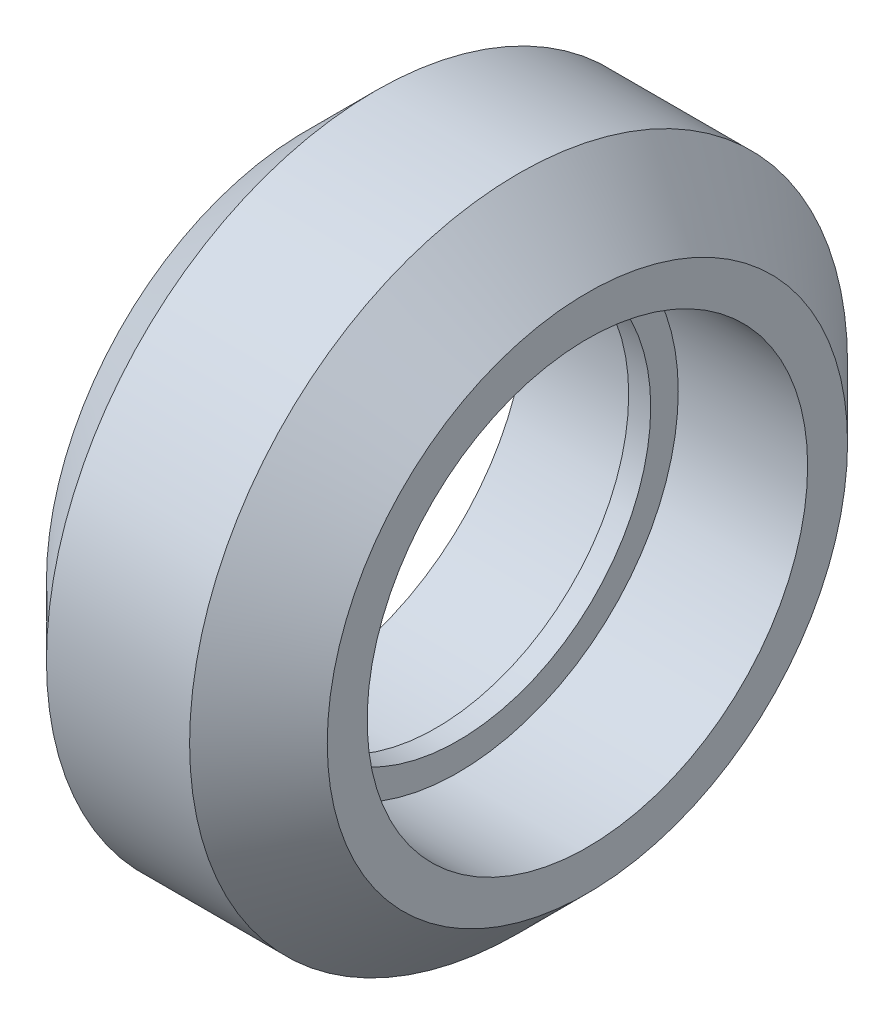
ISO-10303-21;
HEADER;
FILE_DESCRIPTION(('STEP AP214'),'2;1');
FILE_NAME('part.step','',(''),(''),'','','');
FILE_SCHEMA(('AUTOMOTIVE_DESIGN { 1 0 10303 214 1 1 1 1 }'));
ENDSEC;
DATA;
#1=APPLICATION_CONTEXT('core data for automotive mechanical design processes');
#2=APPLICATION_PROTOCOL_DEFINITION('international standard','automotive_design',2000,#1);
#3=PRODUCT_CONTEXT('',#1,'mechanical');
#4=PRODUCT('Part','Part','',(#3));
#5=PRODUCT_RELATED_PRODUCT_CATEGORY('part','',(#4));
#6=PRODUCT_DEFINITION_FORMATION('','',#4);
#7=PRODUCT_DEFINITION_CONTEXT('part definition',#1,'design');
#8=PRODUCT_DEFINITION('design','',#6,#7);
#9=PRODUCT_DEFINITION_SHAPE('','',#8);
#10=(LENGTH_UNIT() NAMED_UNIT(*) SI_UNIT(.MILLI.,.METRE.));
#11=(NAMED_UNIT(*) PLANE_ANGLE_UNIT() SI_UNIT($,.RADIAN.));
#12=(NAMED_UNIT(*) SI_UNIT($,.STERADIAN.) SOLID_ANGLE_UNIT());
#13=UNCERTAINTY_MEASURE_WITH_UNIT(LENGTH_MEASURE(1.E-05),#10,'distance_accuracy_value','');
#14=(GEOMETRIC_REPRESENTATION_CONTEXT(3) GLOBAL_UNCERTAINTY_ASSIGNED_CONTEXT((#13)) GLOBAL_UNIT_ASSIGNED_CONTEXT((#10,
#11,#12)) REPRESENTATION_CONTEXT('',''));
#15=CARTESIAN_POINT('',(0.,0.,0.));
#16=DIRECTION('',(0.,0.,1.));
#17=DIRECTION('',(1.,0.,0.));
#18=AXIS2_PLACEMENT_3D('',#15,#16,#17);
#19=CARTESIAN_POINT('',(-6.28690719540382,1.68978407123177,-0.502602261065022));
#20=DIRECTION('',(1.,0.,0.));
#21=DIRECTION('',(0.,0.,-1.));
#22=AXIS2_PLACEMENT_3D('',#19,#20,#21);
#23=PLANE('',#22);
#24=CARTESIAN_POINT('',(-6.28690719540382,1.68978407123177,-0.502602261065022));
#25=DIRECTION('',(1.,0.,0.));
#26=DIRECTION('',(0.,0.,-1.));
#27=AXIS2_PLACEMENT_3D('',#24,#25,#26);
#28=CIRCLE('',#27,9.44999999999999);
#29=CARTESIAN_POINT('',(-6.28690719540382,1.68978407123177,-9.95260226106501));
#30=VERTEX_POINT('',#29);
#31=EDGE_CURVE('E21',#30,#30,#28,.F.);
#32=ORIENTED_EDGE('',*,*,#31,.T.);
#33=EDGE_LOOP('',(#32));
#34=FACE_BOUND('',#33,.T.);
#35=CARTESIAN_POINT('',(-6.28690719540382,1.68978407123177,-0.502602261065022));
#36=DIRECTION('',(1.,0.,0.));
#37=DIRECTION('',(0.,0.,-1.));
#38=AXIS2_PLACEMENT_3D('',#35,#36,#37);
#39=CIRCLE('',#38,8.);
#40=CARTESIAN_POINT('',(-6.28690719540382,1.68978407123177,-8.50260226106502));
#41=VERTEX_POINT('',#40);
#42=EDGE_CURVE('E38',#41,#41,#39,.T.);
#43=ORIENTED_EDGE('',*,*,#42,.T.);
#44=EDGE_LOOP('',(#43));
#45=FACE_BOUND('',#44,.T.);
#46=ADVANCED_FACE('F14',(#34,#45),#23,.F.);
#47=CARTESIAN_POINT('',(3.91309280459618,1.68978407123177,-0.502602261065022));
#48=DIRECTION('',(-1.,0.,0.));
#49=DIRECTION('',(0.,0.,1.));
#50=AXIS2_PLACEMENT_3D('',#47,#48,#49);
#51=CYLINDRICAL_SURFACE('',#50,11.95);
#52=CARTESIAN_POINT('',(-3.78690719540381,1.68978407123177,-0.502602261065022));
#53=DIRECTION('',(1.,0.,0.));
#54=DIRECTION('',(0.,0.,-1.));
#55=AXIS2_PLACEMENT_3D('',#52,#53,#54);
#56=CIRCLE('',#55,11.95);
#57=CARTESIAN_POINT('',(-3.78690719540381,1.68978407123177,-12.452602261065));
#58=VERTEX_POINT('',#57);
#59=EDGE_CURVE('E25',#58,#58,#56,.T.);
#60=ORIENTED_EDGE('',*,*,#59,.T.);
#61=EDGE_LOOP('',(#60));
#62=FACE_BOUND('',#61,.T.);
#63=CARTESIAN_POINT('',(1.41309280459618,1.68978407123177,-0.502602261065022));
#64=DIRECTION('',(1.,0.,0.));
#65=DIRECTION('',(0.,0.,-1.));
#66=AXIS2_PLACEMENT_3D('',#63,#64,#65);
#67=CIRCLE('',#66,11.95);
#68=CARTESIAN_POINT('',(1.41309280459618,1.68978407123177,-12.452602261065));
#69=VERTEX_POINT('',#68);
#70=EDGE_CURVE('E29',#69,#69,#67,.F.);
#71=ORIENTED_EDGE('',*,*,#70,.T.);
#72=EDGE_LOOP('',(#71));
#73=FACE_BOUND('',#72,.T.);
#74=ADVANCED_FACE('F70',(#62,#73),#51,.T.);
#75=CARTESIAN_POINT('',(3.91309280459618,1.68978407123177,-0.502602261065022));
#76=DIRECTION('',(1.,0.,0.));
#77=DIRECTION('',(0.,0.,-1.));
#78=AXIS2_PLACEMENT_3D('',#75,#76,#77);
#79=PLANE('',#78);
#80=CARTESIAN_POINT('',(3.91309280459618,1.68978407123177,-0.502602261065022));
#81=DIRECTION('',(1.,0.,0.));
#82=DIRECTION('',(0.,0.,-1.));
#83=AXIS2_PLACEMENT_3D('',#80,#81,#82);
#84=CIRCLE('',#83,9.45);
#85=CARTESIAN_POINT('',(3.91309280459618,1.68978407123177,-9.95260226106502));
#86=VERTEX_POINT('',#85);
#87=EDGE_CURVE('E9',#86,#86,#84,.T.);
#88=ORIENTED_EDGE('',*,*,#87,.T.);
#89=EDGE_LOOP('',(#88));
#90=FACE_BOUND('',#89,.T.);
#91=CARTESIAN_POINT('',(3.91309280459618,1.68978407123177,-0.502602261065022));
#92=DIRECTION('',(1.,0.,0.));
#93=DIRECTION('',(0.,0.,-1.));
#94=AXIS2_PLACEMENT_3D('',#91,#92,#93);
#95=CIRCLE('',#94,8.);
#96=CARTESIAN_POINT('',(3.91309280459618,1.68978407123177,-8.50260226106502));
#97=VERTEX_POINT('',#96);
#98=EDGE_CURVE('E40',#97,#97,#95,.T.);
#99=ORIENTED_EDGE('',*,*,#98,.F.);
#100=EDGE_LOOP('',(#99));
#101=FACE_BOUND('',#100,.T.);
#102=ADVANCED_FACE('F65',(#90,#101),#79,.T.);
#103=CARTESIAN_POINT('',(-0.78690719540382,1.68978407123177,-0.502602261065022));
#104=DIRECTION('',(1.,0.,0.));
#105=DIRECTION('',(0.,0.,-1.));
#106=AXIS2_PLACEMENT_3D('',#103,#104,#105);
#107=CYLINDRICAL_SURFACE('',#106,8.);
#108=CARTESIAN_POINT('',(-0.78690719540382,1.68978407123177,-0.502602261065022));
#109=DIRECTION('',(1.,0.,0.));
#110=DIRECTION('',(0.,0.,-1.));
#111=AXIS2_PLACEMENT_3D('',#108,#109,#110);
#112=CIRCLE('',#111,8.);
#113=CARTESIAN_POINT('',(-0.78690719540382,1.68978407123177,-8.50260226106502));
#114=VERTEX_POINT('',#113);
#115=EDGE_CURVE('E34',#114,#114,#112,.T.);
#116=ORIENTED_EDGE('',*,*,#115,.F.);
#117=EDGE_LOOP('',(#116));
#118=FACE_BOUND('',#117,.T.);
#119=ORIENTED_EDGE('',*,*,#98,.T.);
#120=EDGE_LOOP('',(#119));
#121=FACE_BOUND('',#120,.T.);
#122=ADVANCED_FACE('F59',(#118,#121),#107,.F.);
#123=CARTESIAN_POINT('',(-0.78690719540382,1.68978407123177,-0.502602261065022));
#124=DIRECTION('',(1.,0.,0.));
#125=DIRECTION('',(0.,0.,-1.));
#126=AXIS2_PLACEMENT_3D('',#123,#124,#125);
#127=PLANE('',#126);
#128=CARTESIAN_POINT('',(-0.78690719540382,1.68978407123177,-0.502602261065022));
#129=DIRECTION('',(1.,0.,0.));
#130=DIRECTION('',(0.,0.,-1.));
#131=AXIS2_PLACEMENT_3D('',#128,#129,#130);
#132=CIRCLE('',#131,7.);
#133=CARTESIAN_POINT('',(-0.78690719540382,1.68978407123177,-7.50260226106502));
#134=VERTEX_POINT('',#133);
#135=EDGE_CURVE('E39',#134,#134,#132,.T.);
#136=ORIENTED_EDGE('',*,*,#135,.F.);
#137=EDGE_LOOP('',(#136));
#138=FACE_BOUND('',#137,.T.);
#139=ORIENTED_EDGE('',*,*,#115,.T.);
#140=EDGE_LOOP('',(#139));
#141=FACE_BOUND('',#140,.T.);
#142=ADVANCED_FACE('F55',(#138,#141),#127,.T.);
#143=CARTESIAN_POINT('',(-1.58690719540382,1.68978407123177,-0.502602261065022));
#144=DIRECTION('',(-1.,0.,0.));
#145=DIRECTION('',(0.,0.,1.));
#146=AXIS2_PLACEMENT_3D('',#143,#144,#145);
#147=CYLINDRICAL_SURFACE('',#146,8.);
#148=CARTESIAN_POINT('',(-1.58690719540382,1.68978407123177,-0.502602261065022));
#149=DIRECTION('',(1.,0.,0.));
#150=DIRECTION('',(0.,0.,-1.));
#151=AXIS2_PLACEMENT_3D('',#148,#149,#150);
#152=CIRCLE('',#151,8.);
#153=CARTESIAN_POINT('',(-1.58690719540382,1.68978407123177,-8.50260226106502));
#154=VERTEX_POINT('',#153);
#155=EDGE_CURVE('E43',#154,#154,#152,.T.);
#156=ORIENTED_EDGE('',*,*,#155,.T.);
#157=EDGE_LOOP('',(#156));
#158=FACE_BOUND('',#157,.T.);
#159=ORIENTED_EDGE('',*,*,#42,.F.);
#160=EDGE_LOOP('',(#159));
#161=FACE_BOUND('',#160,.T.);
#162=ADVANCED_FACE('F58',(#158,#161),#147,.F.);
#163=CARTESIAN_POINT('',(-1.58690719540382,1.68978407123177,-0.502602261065022));
#164=DIRECTION('',(-1.,0.,0.));
#165=DIRECTION('',(0.,0.,-1.));
#166=AXIS2_PLACEMENT_3D('',#163,#164,#165);
#167=PLANE('',#166);
#168=CARTESIAN_POINT('',(-1.58690719540382,1.68978407123177,-0.502602261065022));
#169=DIRECTION('',(-1.,0.,0.));
#170=DIRECTION('',(0.,0.,1.));
#171=AXIS2_PLACEMENT_3D('',#168,#169,#170);
#172=CIRCLE('',#171,7.);
#173=CARTESIAN_POINT('',(-1.58690719540382,1.68978407123177,6.49739773893498));
#174=VERTEX_POINT('',#173);
#175=EDGE_CURVE('E35',#174,#174,#172,.T.);
#176=ORIENTED_EDGE('',*,*,#175,.F.);
#177=EDGE_LOOP('',(#176));
#178=FACE_BOUND('',#177,.T.);
#179=ORIENTED_EDGE('',*,*,#155,.F.);
#180=EDGE_LOOP('',(#179));
#181=FACE_BOUND('',#180,.T.);
#182=ADVANCED_FACE('F91',(#178,#181),#167,.T.);
#183=CARTESIAN_POINT('',(-3.78690719540382,1.68978407123177,-0.502602261065022));
#184=DIRECTION('',(1.,0.,0.));
#185=DIRECTION('',(0.,0.,-1.));
#186=AXIS2_PLACEMENT_3D('',#183,#184,#185);
#187=CYLINDRICAL_SURFACE('',#186,7.);
#188=ORIENTED_EDGE('',*,*,#175,.T.);
#189=EDGE_LOOP('',(#188));
#190=FACE_BOUND('',#189,.T.);
#191=ORIENTED_EDGE('',*,*,#135,.T.);
#192=EDGE_LOOP('',(#191));
#193=FACE_BOUND('',#192,.T.);
#194=ADVANCED_FACE('F53',(#190,#193),#187,.F.);
#195=CARTESIAN_POINT('',(-3.78690719540381,1.68978407123177,-0.502602261065022));
#196=DIRECTION('',(1.,0.,0.));
#197=DIRECTION('',(0.,0.,-1.));
#198=AXIS2_PLACEMENT_3D('',#195,#196,#197);
#199=CONICAL_SURFACE('',#198,11.95,0.785398163397448);
#200=ORIENTED_EDGE('',*,*,#31,.F.);
#201=EDGE_LOOP('',(#200));
#202=FACE_BOUND('',#201,.T.);
#203=ORIENTED_EDGE('',*,*,#59,.F.);
#204=EDGE_LOOP('',(#203));
#205=FACE_BOUND('',#204,.T.);
#206=ADVANCED_FACE('F83',(#202,#205),#199,.T.);
#207=CARTESIAN_POINT('',(3.91309280459618,1.68978407123177,-0.502602261065022));
#208=DIRECTION('',(-1.,0.,0.));
#209=DIRECTION('',(0.,0.,1.));
#210=AXIS2_PLACEMENT_3D('',#207,#208,#209);
#211=CONICAL_SURFACE('',#210,9.45,0.785398163397448);
#212=ORIENTED_EDGE('',*,*,#70,.F.);
#213=EDGE_LOOP('',(#212));
#214=FACE_BOUND('',#213,.T.);
#215=ORIENTED_EDGE('',*,*,#87,.F.);
#216=EDGE_LOOP('',(#215));
#217=FACE_BOUND('',#216,.T.);
#218=ADVANCED_FACE('F16',(#214,#217),#211,.T.);
#219=CLOSED_SHELL('',(#46,#74,#102,#122,#142,#162,#182,#194,#206,#218));
#220=MANIFOLD_SOLID_BREP('B1',#219);
#221=ADVANCED_BREP_SHAPE_REPRESENTATION('',(#18,#220),#14);
#222=SHAPE_DEFINITION_REPRESENTATION(#9,#221);
ENDSEC;
END-ISO-10303-21;
